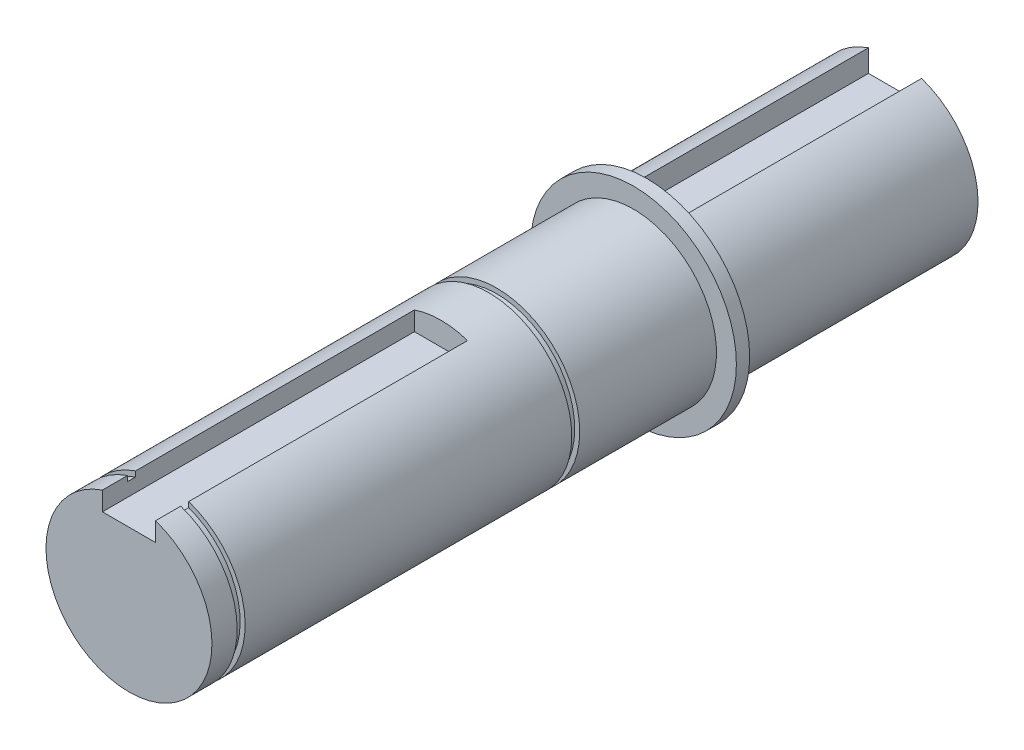
ISO-10303-21;
HEADER;
FILE_DESCRIPTION(('STEP AP214'),'2;1');
FILE_NAME('part.step','',(''),(''),'','','');
FILE_SCHEMA(('AUTOMOTIVE_DESIGN { 1 0 10303 214 1 1 1 1 }'));
ENDSEC;
DATA;
#1=APPLICATION_CONTEXT('core data for automotive mechanical design processes');
#2=APPLICATION_PROTOCOL_DEFINITION('international standard','automotive_design',2000,#1);
#3=PRODUCT_CONTEXT('',#1,'mechanical');
#4=PRODUCT('Part','Part','',(#3));
#5=PRODUCT_RELATED_PRODUCT_CATEGORY('part','',(#4));
#6=PRODUCT_DEFINITION_FORMATION('','',#4);
#7=PRODUCT_DEFINITION_CONTEXT('part definition',#1,'design');
#8=PRODUCT_DEFINITION('design','',#6,#7);
#9=PRODUCT_DEFINITION_SHAPE('','',#8);
#10=(LENGTH_UNIT() NAMED_UNIT(*) SI_UNIT(.MILLI.,.METRE.));
#11=(NAMED_UNIT(*) PLANE_ANGLE_UNIT() SI_UNIT($,.RADIAN.));
#12=(NAMED_UNIT(*) SI_UNIT($,.STERADIAN.) SOLID_ANGLE_UNIT());
#13=UNCERTAINTY_MEASURE_WITH_UNIT(LENGTH_MEASURE(1.E-05),#10,'distance_accuracy_value','');
#14=(GEOMETRIC_REPRESENTATION_CONTEXT(3) GLOBAL_UNCERTAINTY_ASSIGNED_CONTEXT((#13)) GLOBAL_UNIT_ASSIGNED_CONTEXT((#10,
#11,#12)) REPRESENTATION_CONTEXT('',''));
#15=CARTESIAN_POINT('',(0.,0.,0.));
#16=DIRECTION('',(0.,0.,1.));
#17=DIRECTION('',(1.,0.,0.));
#18=AXIS2_PLACEMENT_3D('',#15,#16,#17);
#19=CARTESIAN_POINT('',(0.,0.,115.4));
#20=DIRECTION('',(0.,0.,-1.));
#21=DIRECTION('',(-1.,0.,0.));
#22=AXIS2_PLACEMENT_3D('',#19,#20,#21);
#23=CYLINDRICAL_SURFACE('',#22,12.5);
#24=CARTESIAN_POINT('',(0.,0.,61.2));
#25=DIRECTION('',(0.,0.,1.));
#26=DIRECTION('',(1.,0.,0.));
#27=AXIS2_PLACEMENT_3D('',#24,#25,#26);
#28=CIRCLE('',#27,12.5);
#29=CARTESIAN_POINT('',(12.5,0.,61.2));
#30=VERTEX_POINT('',#29);
#31=EDGE_CURVE('E198',#30,#30,#28,.T.);
#32=ORIENTED_EDGE('',*,*,#31,.T.);
#33=EDGE_LOOP('',(#32));
#34=FACE_BOUND('',#33,.T.);
#35=CARTESIAN_POINT('',(0.,0.,110.4));
#36=DIRECTION('',(0.,0.,1.));
#37=DIRECTION('',(1.,0.,0.));
#38=AXIS2_PLACEMENT_3D('',#35,#36,#37);
#39=CIRCLE('',#38,12.5);
#40=CARTESIAN_POINT('',(-4.,11.842719282327,110.4));
#41=VERTEX_POINT('',#40);
#42=CARTESIAN_POINT('',(4.,11.842719282327,110.4));
#43=VERTEX_POINT('',#42);
#44=EDGE_CURVE('E153',#41,#43,#39,.T.);
#45=ORIENTED_EDGE('',*,*,#44,.F.);
#46=DIRECTION('',(0.,0.,-1.));
#47=VECTOR('',#46,1.);
#48=CARTESIAN_POINT('',(-4.,11.842719282327,115.4));
#49=LINE('',#48,#47);
#50=CARTESIAN_POINT('',(-4.,11.842719282327,68.4));
#51=VERTEX_POINT('',#50);
#52=EDGE_CURVE('E274',#41,#51,#49,.T.);
#53=ORIENTED_EDGE('',*,*,#52,.T.);
#54=CARTESIAN_POINT('',(0.,0.,68.4));
#55=DIRECTION('',(0.,0.,-1.));
#56=DIRECTION('',(-1.,0.,0.));
#57=AXIS2_PLACEMENT_3D('',#54,#55,#56);
#58=CIRCLE('',#57,12.5);
#59=CARTESIAN_POINT('',(4.,11.842719282327,68.4));
#60=VERTEX_POINT('',#59);
#61=EDGE_CURVE('E270',#51,#60,#58,.T.);
#62=ORIENTED_EDGE('',*,*,#61,.T.);
#63=DIRECTION('',(0.,0.,-1.));
#64=VECTOR('',#63,1.);
#65=CARTESIAN_POINT('',(4.,11.842719282327,115.4));
#66=LINE('',#65,#64);
#67=EDGE_CURVE('E279',#60,#43,#66,.F.);
#68=ORIENTED_EDGE('',*,*,#67,.T.);
#69=EDGE_LOOP('',(#45,#53,#62,#68));
#70=FACE_BOUND('',#69,.T.);
#71=ADVANCED_FACE('F45',(#34,#70),#23,.T.);
#72=CARTESIAN_POINT('',(0.,0.,39.4));
#73=DIRECTION('',(0.,0.,-1.));
#74=DIRECTION('',(-1.,0.,0.));
#75=AXIS2_PLACEMENT_3D('',#72,#73,#74);
#76=CIRCLE('',#75,12.5);
#77=CARTESIAN_POINT('',(-12.5,0.,39.4));
#78=VERTEX_POINT('',#77);
#79=EDGE_CURVE('E263',#78,#78,#76,.T.);
#80=ORIENTED_EDGE('',*,*,#79,.F.);
#81=EDGE_LOOP('',(#80));
#82=FACE_BOUND('',#81,.T.);
#83=CARTESIAN_POINT('',(0.,0.,60.));
#84=DIRECTION('',(0.,0.,1.));
#85=DIRECTION('',(1.,0.,0.));
#86=AXIS2_PLACEMENT_3D('',#83,#84,#85);
#87=CIRCLE('',#86,12.5);
#88=CARTESIAN_POINT('',(12.5,0.,60.));
#89=VERTEX_POINT('',#88);
#90=EDGE_CURVE('E194',#89,#89,#87,.T.);
#91=ORIENTED_EDGE('',*,*,#90,.F.);
#92=EDGE_LOOP('',(#91));
#93=FACE_BOUND('',#92,.T.);
#94=ADVANCED_FACE('F322',(#82,#93),#23,.T.);
#95=CARTESIAN_POINT('',(0.,0.,37.4));
#96=DIRECTION('',(0.,0.,-1.));
#97=DIRECTION('',(-1.,0.,0.));
#98=AXIS2_PLACEMENT_3D('',#95,#96,#97);
#99=CIRCLE('',#98,12.5);
#100=CARTESIAN_POINT('',(-12.5,0.,37.4));
#101=VERTEX_POINT('',#100);
#102=EDGE_CURVE('E210',#101,#101,#99,.T.);
#103=ORIENTED_EDGE('',*,*,#102,.T.);
#104=EDGE_LOOP('',(#103));
#105=FACE_BOUND('',#104,.T.);
#106=CARTESIAN_POINT('',(0.,0.,35.4));
#107=DIRECTION('',(0.,0.,1.));
#108=DIRECTION('',(1.,0.,0.));
#109=AXIS2_PLACEMENT_3D('',#106,#107,#108);
#110=CIRCLE('',#109,12.5);
#111=CARTESIAN_POINT('',(4.,11.842719282327,35.4));
#112=VERTEX_POINT('',#111);
#113=CARTESIAN_POINT('',(-4.,11.842719282327,35.4));
#114=VERTEX_POINT('',#113);
#115=EDGE_CURVE('E259',#112,#114,#110,.T.);
#116=ORIENTED_EDGE('',*,*,#115,.T.);
#117=DIRECTION('',(0.,0.,-1.));
#118=VECTOR('',#117,1.);
#119=CARTESIAN_POINT('',(-4.,11.842719282327,115.4));
#120=LINE('',#119,#118);
#121=CARTESIAN_POINT('',(-4.,11.842719282327,0.));
#122=VERTEX_POINT('',#121);
#123=EDGE_CURVE('E243',#114,#122,#120,.T.);
#124=ORIENTED_EDGE('',*,*,#123,.T.);
#125=CARTESIAN_POINT('',(0.,0.,0.));
#126=DIRECTION('',(0.,0.,1.));
#127=DIRECTION('',(1.,0.,0.));
#128=AXIS2_PLACEMENT_3D('',#125,#126,#127);
#129=CIRCLE('',#128,12.5);
#130=CARTESIAN_POINT('',(4.,11.842719282327,0.));
#131=VERTEX_POINT('',#130);
#132=EDGE_CURVE('E247',#122,#131,#129,.T.);
#133=ORIENTED_EDGE('',*,*,#132,.T.);
#134=DIRECTION('',(0.,0.,-1.));
#135=VECTOR('',#134,1.);
#136=CARTESIAN_POINT('',(4.,11.842719282327,115.4));
#137=LINE('',#136,#135);
#138=EDGE_CURVE('E236',#131,#112,#137,.F.);
#139=ORIENTED_EDGE('',*,*,#138,.T.);
#140=EDGE_LOOP('',(#116,#124,#133,#139));
#141=FACE_BOUND('',#140,.T.);
#142=ADVANCED_FACE('F47',(#105,#141),#23,.T.);
#143=CARTESIAN_POINT('',(0.,0.,0.));
#144=DIRECTION('',(0.,0.,1.));
#145=DIRECTION('',(1.,0.,0.));
#146=AXIS2_PLACEMENT_3D('',#143,#144,#145);
#147=PLANE('',#146);
#148=ORIENTED_EDGE('',*,*,#132,.F.);
#149=DIRECTION('',(0.,1.,0.));
#150=VECTOR('',#149,1.);
#151=CARTESIAN_POINT('',(-4.,8.5,0.));
#152=LINE('',#151,#150);
#153=CARTESIAN_POINT('',(-4.,8.5,0.));
#154=VERTEX_POINT('',#153);
#155=EDGE_CURVE('E227',#154,#122,#152,.T.);
#156=ORIENTED_EDGE('',*,*,#155,.F.);
#157=DIRECTION('',(-1.,0.,0.));
#158=VECTOR('',#157,1.);
#159=CARTESIAN_POINT('',(4.,8.5,0.));
#160=LINE('',#159,#158);
#161=CARTESIAN_POINT('',(4.,8.5,0.));
#162=VERTEX_POINT('',#161);
#163=EDGE_CURVE('E219',#162,#154,#160,.T.);
#164=ORIENTED_EDGE('',*,*,#163,.F.);
#165=DIRECTION('',(0.,1.,0.));
#166=VECTOR('',#165,1.);
#167=CARTESIAN_POINT('',(4.,0.,0.));
#168=LINE('',#167,#166);
#169=EDGE_CURVE('E252',#162,#131,#168,.T.);
#170=ORIENTED_EDGE('',*,*,#169,.T.);
#171=EDGE_LOOP('',(#148,#156,#164,#170));
#172=FACE_BOUND('',#171,.T.);
#173=ADVANCED_FACE('F329',(#172),#147,.F.);
#174=CARTESIAN_POINT('',(0.,0.,35.4));
#175=DIRECTION('',(0.,0.,1.));
#176=DIRECTION('',(1.,0.,0.));
#177=AXIS2_PLACEMENT_3D('',#174,#175,#176);
#178=PLANE('',#177);
#179=DIRECTION('',(0.,-1.,0.));
#180=VECTOR('',#179,1.);
#181=CARTESIAN_POINT('',(4.,8.5,35.4));
#182=LINE('',#181,#180);
#183=CARTESIAN_POINT('',(4.,8.5,35.4));
#184=VERTEX_POINT('',#183);
#185=EDGE_CURVE('E218',#112,#184,#182,.T.);
#186=ORIENTED_EDGE('',*,*,#185,.T.);
#187=DIRECTION('',(-1.,0.,0.));
#188=VECTOR('',#187,1.);
#189=CARTESIAN_POINT('',(4.,8.5,35.4));
#190=LINE('',#189,#188);
#191=CARTESIAN_POINT('',(-4.,8.5,35.4));
#192=VERTEX_POINT('',#191);
#193=EDGE_CURVE('E222',#184,#192,#190,.T.);
#194=ORIENTED_EDGE('',*,*,#193,.T.);
#195=DIRECTION('',(0.,1.,0.));
#196=VECTOR('',#195,1.);
#197=CARTESIAN_POINT('',(-4.,8.5,35.4));
#198=LINE('',#197,#196);
#199=EDGE_CURVE('E214',#192,#114,#198,.T.);
#200=ORIENTED_EDGE('',*,*,#199,.T.);
#201=ORIENTED_EDGE('',*,*,#115,.F.);
#202=EDGE_LOOP('',(#186,#194,#200,#201));
#203=FACE_BOUND('',#202,.T.);
#204=ADVANCED_FACE('F334',(#203),#178,.F.);
#205=CARTESIAN_POINT('',(-4.,8.5,35.4));
#206=DIRECTION('',(-1.,0.,0.));
#207=DIRECTION('',(0.,0.,1.));
#208=AXIS2_PLACEMENT_3D('',#205,#206,#207);
#209=PLANE('',#208);
#210=ORIENTED_EDGE('',*,*,#199,.F.);
#211=DIRECTION('',(0.,0.,-1.));
#212=VECTOR('',#211,1.);
#213=CARTESIAN_POINT('',(-4.,8.5,35.4));
#214=LINE('',#213,#212);
#215=EDGE_CURVE('E233',#192,#154,#214,.T.);
#216=ORIENTED_EDGE('',*,*,#215,.T.);
#217=ORIENTED_EDGE('',*,*,#155,.T.);
#218=ORIENTED_EDGE('',*,*,#123,.F.);
#219=EDGE_LOOP('',(#210,#216,#217,#218));
#220=FACE_BOUND('',#219,.T.);
#221=ADVANCED_FACE('F352',(#220),#209,.F.);
#222=CARTESIAN_POINT('',(4.,8.5,35.4));
#223=DIRECTION('',(1.,0.,0.));
#224=DIRECTION('',(0.,0.,-1.));
#225=AXIS2_PLACEMENT_3D('',#222,#223,#224);
#226=PLANE('',#225);
#227=ORIENTED_EDGE('',*,*,#169,.F.);
#228=DIRECTION('',(0.,0.,-1.));
#229=VECTOR('',#228,1.);
#230=CARTESIAN_POINT('',(4.,8.5,35.4));
#231=LINE('',#230,#229);
#232=EDGE_CURVE('E226',#184,#162,#231,.T.);
#233=ORIENTED_EDGE('',*,*,#232,.F.);
#234=ORIENTED_EDGE('',*,*,#185,.F.);
#235=ORIENTED_EDGE('',*,*,#138,.F.);
#236=EDGE_LOOP('',(#227,#233,#234,#235));
#237=FACE_BOUND('',#236,.T.);
#238=ADVANCED_FACE('F355',(#237),#226,.F.);
#239=CARTESIAN_POINT('',(4.,8.5,35.4));
#240=DIRECTION('',(0.,-1.,0.));
#241=DIRECTION('',(0.,0.,-1.));
#242=AXIS2_PLACEMENT_3D('',#239,#240,#241);
#243=PLANE('',#242);
#244=ORIENTED_EDGE('',*,*,#163,.T.);
#245=ORIENTED_EDGE('',*,*,#215,.F.);
#246=ORIENTED_EDGE('',*,*,#193,.F.);
#247=ORIENTED_EDGE('',*,*,#232,.T.);
#248=EDGE_LOOP('',(#244,#245,#246,#247));
#249=FACE_BOUND('',#248,.T.);
#250=ADVANCED_FACE('F359',(#249),#243,.F.);
#251=CARTESIAN_POINT('',(0.,0.,39.4));
#252=DIRECTION('',(0.,0.,-1.));
#253=DIRECTION('',(-1.,0.,0.));
#254=AXIS2_PLACEMENT_3D('',#251,#252,#253);
#255=CYLINDRICAL_SURFACE('',#254,15.5);
#256=CARTESIAN_POINT('',(0.,0.,39.4));
#257=DIRECTION('',(0.,0.,-1.));
#258=DIRECTION('',(-1.,0.,0.));
#259=AXIS2_PLACEMENT_3D('',#256,#257,#258);
#260=CIRCLE('',#259,15.5);
#261=CARTESIAN_POINT('',(-15.5,0.,39.4));
#262=VERTEX_POINT('',#261);
#263=EDGE_CURVE('E206',#262,#262,#260,.T.);
#264=ORIENTED_EDGE('',*,*,#263,.T.);
#265=EDGE_LOOP('',(#264));
#266=FACE_BOUND('',#265,.T.);
#267=CARTESIAN_POINT('',(0.,0.,37.4));
#268=DIRECTION('',(0.,0.,-1.));
#269=DIRECTION('',(-1.,0.,0.));
#270=AXIS2_PLACEMENT_3D('',#267,#268,#269);
#271=CIRCLE('',#270,15.5);
#272=CARTESIAN_POINT('',(-15.5,0.,37.4));
#273=VERTEX_POINT('',#272);
#274=EDGE_CURVE('E202',#273,#273,#271,.T.);
#275=ORIENTED_EDGE('',*,*,#274,.F.);
#276=EDGE_LOOP('',(#275));
#277=FACE_BOUND('',#276,.T.);
#278=ADVANCED_FACE('F363',(#266,#277),#255,.T.);
#279=CARTESIAN_POINT('',(0.,0.,39.4));
#280=DIRECTION('',(0.,0.,-1.));
#281=DIRECTION('',(-1.,0.,0.));
#282=AXIS2_PLACEMENT_3D('',#279,#280,#281);
#283=PLANE('',#282);
#284=ORIENTED_EDGE('',*,*,#79,.T.);
#285=EDGE_LOOP('',(#284));
#286=FACE_BOUND('',#285,.T.);
#287=ORIENTED_EDGE('',*,*,#263,.F.);
#288=EDGE_LOOP('',(#287));
#289=FACE_BOUND('',#288,.T.);
#290=ADVANCED_FACE('F370',(#286,#289),#283,.F.);
#291=CARTESIAN_POINT('',(0.,0.,37.4));
#292=DIRECTION('',(0.,0.,-1.));
#293=DIRECTION('',(-1.,0.,0.));
#294=AXIS2_PLACEMENT_3D('',#291,#292,#293);
#295=PLANE('',#294);
#296=ORIENTED_EDGE('',*,*,#102,.F.);
#297=EDGE_LOOP('',(#296));
#298=FACE_BOUND('',#297,.T.);
#299=ORIENTED_EDGE('',*,*,#274,.T.);
#300=EDGE_LOOP('',(#299));
#301=FACE_BOUND('',#300,.T.);
#302=ADVANCED_FACE('F372',(#298,#301),#295,.T.);
#303=CARTESIAN_POINT('',(0.,0.,61.2));
#304=DIRECTION('',(0.,0.,1.));
#305=DIRECTION('',(1.,0.,0.));
#306=AXIS2_PLACEMENT_3D('',#303,#304,#305);
#307=PLANE('',#306);
#308=ORIENTED_EDGE('',*,*,#31,.F.);
#309=EDGE_LOOP('',(#308));
#310=FACE_BOUND('',#309,.T.);
#311=CARTESIAN_POINT('',(0.,0.,61.2));
#312=DIRECTION('',(0.,0.,1.));
#313=DIRECTION('',(1.,0.,0.));
#314=AXIS2_PLACEMENT_3D('',#311,#312,#313);
#315=CIRCLE('',#314,11.75);
#316=CARTESIAN_POINT('',(11.75,0.,61.2));
#317=VERTEX_POINT('',#316);
#318=EDGE_CURVE('E190',#317,#317,#315,.T.);
#319=ORIENTED_EDGE('',*,*,#318,.T.);
#320=EDGE_LOOP('',(#319));
#321=FACE_BOUND('',#320,.T.);
#322=ADVANCED_FACE('F375',(#310,#321),#307,.F.);
#323=CARTESIAN_POINT('',(0.,0.,60.));
#324=DIRECTION('',(0.,0.,1.));
#325=DIRECTION('',(1.,0.,0.));
#326=AXIS2_PLACEMENT_3D('',#323,#324,#325);
#327=PLANE('',#326);
#328=ORIENTED_EDGE('',*,*,#90,.T.);
#329=EDGE_LOOP('',(#328));
#330=FACE_BOUND('',#329,.T.);
#331=CARTESIAN_POINT('',(0.,0.,60.));
#332=DIRECTION('',(0.,0.,1.));
#333=DIRECTION('',(1.,0.,0.));
#334=AXIS2_PLACEMENT_3D('',#331,#332,#333);
#335=CIRCLE('',#334,11.75);
#336=CARTESIAN_POINT('',(11.75,0.,60.));
#337=VERTEX_POINT('',#336);
#338=EDGE_CURVE('E186',#337,#337,#335,.T.);
#339=ORIENTED_EDGE('',*,*,#338,.F.);
#340=EDGE_LOOP('',(#339));
#341=FACE_BOUND('',#340,.T.);
#342=ADVANCED_FACE('F348',(#330,#341),#327,.T.);
#343=CARTESIAN_POINT('',(0.,0.,61.2));
#344=DIRECTION('',(0.,0.,-1.));
#345=DIRECTION('',(-1.,0.,0.));
#346=AXIS2_PLACEMENT_3D('',#343,#344,#345);
#347=CYLINDRICAL_SURFACE('',#346,11.75);
#348=ORIENTED_EDGE('',*,*,#318,.F.);
#349=EDGE_LOOP('',(#348));
#350=FACE_BOUND('',#349,.T.);
#351=ORIENTED_EDGE('',*,*,#338,.T.);
#352=EDGE_LOOP('',(#351));
#353=FACE_BOUND('',#352,.T.);
#354=ADVANCED_FACE('F343',(#350,#353),#347,.T.);
#355=CARTESIAN_POINT('',(0.,0.,115.4));
#356=DIRECTION('',(0.,0.,1.));
#357=DIRECTION('',(1.,0.,0.));
#358=AXIS2_PLACEMENT_3D('',#355,#356,#357);
#359=PLANE('',#358);
#360=DIRECTION('',(0.,1.,0.));
#361=VECTOR('',#360,1.);
#362=CARTESIAN_POINT('',(4.,9.,115.4));
#363=LINE('',#362,#361);
#364=CARTESIAN_POINT('',(4.,9.,115.4));
#365=VERTEX_POINT('',#364);
#366=CARTESIAN_POINT('',(4.,11.842719282327,115.4));
#367=VERTEX_POINT('',#366);
#368=EDGE_CURVE('E160',#365,#367,#363,.T.);
#369=ORIENTED_EDGE('',*,*,#368,.F.);
#370=DIRECTION('',(1.,0.,0.));
#371=VECTOR('',#370,1.);
#372=CARTESIAN_POINT('',(-4.,9.,115.4));
#373=LINE('',#372,#371);
#374=CARTESIAN_POINT('',(-4.,9.,115.4));
#375=VERTEX_POINT('',#374);
#376=EDGE_CURVE('E171',#375,#365,#373,.T.);
#377=ORIENTED_EDGE('',*,*,#376,.F.);
#378=DIRECTION('',(0.,-1.,0.));
#379=VECTOR('',#378,1.);
#380=CARTESIAN_POINT('',(-4.,9.,115.4));
#381=LINE('',#380,#379);
#382=CARTESIAN_POINT('',(-4.,11.842719282327,115.4));
#383=VERTEX_POINT('',#382);
#384=EDGE_CURVE('E164',#383,#375,#381,.T.);
#385=ORIENTED_EDGE('',*,*,#384,.F.);
#386=CARTESIAN_POINT('',(0.,0.,115.4));
#387=DIRECTION('',(0.,0.,1.));
#388=DIRECTION('',(1.,0.,0.));
#389=AXIS2_PLACEMENT_3D('',#386,#387,#388);
#390=CIRCLE('',#389,12.5);
#391=EDGE_CURVE('E248',#383,#367,#390,.T.);
#392=ORIENTED_EDGE('',*,*,#391,.T.);
#393=EDGE_LOOP('',(#369,#377,#385,#392));
#394=FACE_BOUND('',#393,.T.);
#395=ADVANCED_FACE('F307',(#394),#359,.T.);
#396=CARTESIAN_POINT('',(-4.,11.842719282327,111.6));
#397=VERTEX_POINT('',#396);
#398=EDGE_CURVE('E275',#383,#397,#49,.T.);
#399=ORIENTED_EDGE('',*,*,#398,.T.);
#400=CARTESIAN_POINT('',(0.,0.,111.6));
#401=DIRECTION('',(0.,0.,1.));
#402=DIRECTION('',(1.,0.,0.));
#403=AXIS2_PLACEMENT_3D('',#400,#401,#402);
#404=CIRCLE('',#403,12.5);
#405=CARTESIAN_POINT('',(4.,11.842719282327,111.6));
#406=VERTEX_POINT('',#405);
#407=EDGE_CURVE('E145',#397,#406,#404,.T.);
#408=ORIENTED_EDGE('',*,*,#407,.T.);
#409=EDGE_CURVE('E158',#406,#367,#66,.F.);
#410=ORIENTED_EDGE('',*,*,#409,.T.);
#411=ORIENTED_EDGE('',*,*,#391,.F.);
#412=EDGE_LOOP('',(#399,#408,#410,#411));
#413=FACE_BOUND('',#412,.T.);
#414=ADVANCED_FACE('F302',(#413),#23,.T.);
#415=CARTESIAN_POINT('',(4.,9.,68.4));
#416=DIRECTION('',(1.,0.,0.));
#417=DIRECTION('',(0.,0.,-1.));
#418=AXIS2_PLACEMENT_3D('',#415,#416,#417);
#419=PLANE('',#418);
#420=ORIENTED_EDGE('',*,*,#409,.F.);
#421=DIRECTION('',(0.,-1.,0.));
#422=VECTOR('',#421,1.);
#423=CARTESIAN_POINT('',(4.,9.,111.6));
#424=LINE('',#423,#422);
#425=CARTESIAN_POINT('',(4.,11.0481898969922,111.6));
#426=VERTEX_POINT('',#425);
#427=EDGE_CURVE('E149',#406,#426,#424,.T.);
#428=ORIENTED_EDGE('',*,*,#427,.T.);
#429=DIRECTION('',(0.,0.,-1.));
#430=VECTOR('',#429,1.);
#431=CARTESIAN_POINT('',(4.,11.0481898969922,111.6));
#432=LINE('',#431,#430);
#433=CARTESIAN_POINT('',(4.,11.0481898969922,110.4));
#434=VERTEX_POINT('',#433);
#435=EDGE_CURVE('E136',#426,#434,#432,.T.);
#436=ORIENTED_EDGE('',*,*,#435,.T.);
#437=DIRECTION('',(0.,-1.,0.));
#438=VECTOR('',#437,1.);
#439=CARTESIAN_POINT('',(4.,9.,110.4));
#440=LINE('',#439,#438);
#441=EDGE_CURVE('E144',#43,#434,#440,.T.);
#442=ORIENTED_EDGE('',*,*,#441,.F.);
#443=ORIENTED_EDGE('',*,*,#67,.F.);
#444=DIRECTION('',(0.,1.,0.));
#445=VECTOR('',#444,1.);
#446=CARTESIAN_POINT('',(4.,9.,68.4));
#447=LINE('',#446,#445);
#448=CARTESIAN_POINT('',(4.,9.,68.4));
#449=VERTEX_POINT('',#448);
#450=EDGE_CURVE('E69',#449,#60,#447,.T.);
#451=ORIENTED_EDGE('',*,*,#450,.F.);
#452=DIRECTION('',(0.,0.,1.));
#453=VECTOR('',#452,1.);
#454=CARTESIAN_POINT('',(4.,9.,68.4));
#455=LINE('',#454,#453);
#456=EDGE_CURVE('E183',#449,#365,#455,.T.);
#457=ORIENTED_EDGE('',*,*,#456,.T.);
#458=ORIENTED_EDGE('',*,*,#368,.T.);
#459=EDGE_LOOP('',(#420,#428,#436,#442,#443,#451,#457,#458));
#460=FACE_BOUND('',#459,.T.);
#461=ADVANCED_FACE('F156',(#460),#419,.F.);
#462=CARTESIAN_POINT('',(-4.,9.,68.4));
#463=DIRECTION('',(-1.,0.,0.));
#464=DIRECTION('',(0.,0.,1.));
#465=AXIS2_PLACEMENT_3D('',#462,#463,#464);
#466=PLANE('',#465);
#467=DIRECTION('',(0.,0.,-1.));
#468=VECTOR('',#467,1.);
#469=CARTESIAN_POINT('',(-4.,11.0481898969922,111.6));
#470=LINE('',#469,#468);
#471=CARTESIAN_POINT('',(-4.,11.0481898969922,110.4));
#472=VERTEX_POINT('',#471);
#473=CARTESIAN_POINT('',(-4.,11.0481898969922,111.6));
#474=VERTEX_POINT('',#473);
#475=EDGE_CURVE('E283',#472,#474,#470,.F.);
#476=ORIENTED_EDGE('',*,*,#475,.T.);
#477=DIRECTION('',(0.,1.,0.));
#478=VECTOR('',#477,1.);
#479=CARTESIAN_POINT('',(-4.,9.,111.6));
#480=LINE('',#479,#478);
#481=EDGE_CURVE('E12',#474,#397,#480,.T.);
#482=ORIENTED_EDGE('',*,*,#481,.T.);
#483=ORIENTED_EDGE('',*,*,#398,.F.);
#484=ORIENTED_EDGE('',*,*,#384,.T.);
#485=DIRECTION('',(0.,0.,1.));
#486=VECTOR('',#485,1.);
#487=CARTESIAN_POINT('',(-4.,9.,68.4));
#488=LINE('',#487,#486);
#489=CARTESIAN_POINT('',(-4.,9.,68.4));
#490=VERTEX_POINT('',#489);
#491=EDGE_CURVE('E176',#490,#375,#488,.T.);
#492=ORIENTED_EDGE('',*,*,#491,.F.);
#493=DIRECTION('',(0.,-1.,0.));
#494=VECTOR('',#493,1.);
#495=CARTESIAN_POINT('',(-4.,9.,68.4));
#496=LINE('',#495,#494);
#497=EDGE_CURVE('E170',#51,#490,#496,.T.);
#498=ORIENTED_EDGE('',*,*,#497,.F.);
#499=ORIENTED_EDGE('',*,*,#52,.F.);
#500=DIRECTION('',(0.,1.,0.));
#501=VECTOR('',#500,1.);
#502=CARTESIAN_POINT('',(-4.,9.,110.4));
#503=LINE('',#502,#501);
#504=EDGE_CURVE('E54',#472,#41,#503,.T.);
#505=ORIENTED_EDGE('',*,*,#504,.F.);
#506=EDGE_LOOP('',(#476,#482,#483,#484,#492,#498,#499,#505));
#507=FACE_BOUND('',#506,.T.);
#508=ADVANCED_FACE('F296',(#507),#466,.F.);
#509=CARTESIAN_POINT('',(0.,0.,68.4));
#510=DIRECTION('',(0.,0.,-1.));
#511=DIRECTION('',(-1.,0.,0.));
#512=AXIS2_PLACEMENT_3D('',#509,#510,#511);
#513=PLANE('',#512);
#514=ORIENTED_EDGE('',*,*,#497,.T.);
#515=DIRECTION('',(1.,0.,0.));
#516=VECTOR('',#515,1.);
#517=CARTESIAN_POINT('',(-4.,9.,68.4));
#518=LINE('',#517,#516);
#519=EDGE_CURVE('E174',#490,#449,#518,.T.);
#520=ORIENTED_EDGE('',*,*,#519,.T.);
#521=ORIENTED_EDGE('',*,*,#450,.T.);
#522=ORIENTED_EDGE('',*,*,#61,.F.);
#523=EDGE_LOOP('',(#514,#520,#521,#522));
#524=FACE_BOUND('',#523,.T.);
#525=ADVANCED_FACE('F311',(#524),#513,.F.);
#526=CARTESIAN_POINT('',(-4.,9.,68.4));
#527=DIRECTION('',(0.,-1.,0.));
#528=DIRECTION('',(0.,0.,-1.));
#529=AXIS2_PLACEMENT_3D('',#526,#527,#528);
#530=PLANE('',#529);
#531=ORIENTED_EDGE('',*,*,#376,.T.);
#532=ORIENTED_EDGE('',*,*,#456,.F.);
#533=ORIENTED_EDGE('',*,*,#519,.F.);
#534=ORIENTED_EDGE('',*,*,#491,.T.);
#535=EDGE_LOOP('',(#531,#532,#533,#534));
#536=FACE_BOUND('',#535,.T.);
#537=ADVANCED_FACE('F310',(#536),#530,.F.);
#538=CARTESIAN_POINT('',(0.,0.,111.6));
#539=DIRECTION('',(0.,0.,1.));
#540=DIRECTION('',(1.,0.,0.));
#541=AXIS2_PLACEMENT_3D('',#538,#539,#540);
#542=PLANE('',#541);
#543=ORIENTED_EDGE('',*,*,#407,.F.);
#544=ORIENTED_EDGE('',*,*,#481,.F.);
#545=CARTESIAN_POINT('',(0.,0.,111.6));
#546=DIRECTION('',(0.,0.,1.));
#547=DIRECTION('',(1.,0.,0.));
#548=AXIS2_PLACEMENT_3D('',#545,#546,#547);
#549=CIRCLE('',#548,11.75);
#550=EDGE_CURVE('E61',#474,#426,#549,.T.);
#551=ORIENTED_EDGE('',*,*,#550,.T.);
#552=ORIENTED_EDGE('',*,*,#427,.F.);
#553=EDGE_LOOP('',(#543,#544,#551,#552));
#554=FACE_BOUND('',#553,.T.);
#555=ADVANCED_FACE('F148',(#554),#542,.F.);
#556=CARTESIAN_POINT('',(0.,0.,110.4));
#557=DIRECTION('',(0.,0.,1.));
#558=DIRECTION('',(1.,0.,0.));
#559=AXIS2_PLACEMENT_3D('',#556,#557,#558);
#560=PLANE('',#559);
#561=ORIENTED_EDGE('',*,*,#441,.T.);
#562=CARTESIAN_POINT('',(0.,0.,110.4));
#563=DIRECTION('',(0.,0.,1.));
#564=DIRECTION('',(1.,0.,0.));
#565=AXIS2_PLACEMENT_3D('',#562,#563,#564);
#566=CIRCLE('',#565,11.75);
#567=EDGE_CURVE('E139',#472,#434,#566,.T.);
#568=ORIENTED_EDGE('',*,*,#567,.F.);
#569=ORIENTED_EDGE('',*,*,#504,.T.);
#570=ORIENTED_EDGE('',*,*,#44,.T.);
#571=EDGE_LOOP('',(#561,#568,#569,#570));
#572=FACE_BOUND('',#571,.T.);
#573=ADVANCED_FACE('F289',(#572),#560,.T.);
#574=CARTESIAN_POINT('',(0.,0.,111.6));
#575=DIRECTION('',(0.,0.,-1.));
#576=DIRECTION('',(-1.,0.,0.));
#577=AXIS2_PLACEMENT_3D('',#574,#575,#576);
#578=CYLINDRICAL_SURFACE('',#577,11.75);
#579=ORIENTED_EDGE('',*,*,#550,.F.);
#580=ORIENTED_EDGE('',*,*,#475,.F.);
#581=ORIENTED_EDGE('',*,*,#567,.T.);
#582=ORIENTED_EDGE('',*,*,#435,.F.);
#583=EDGE_LOOP('',(#579,#580,#581,#582));
#584=FACE_BOUND('',#583,.T.);
#585=ADVANCED_FACE('F137',(#584),#578,.T.);
#586=CLOSED_SHELL('',(#71,#94,#142,#173,#204,#221,#238,#250,#278,#290,#302,#322,#342,#354,#395,
#414,#461,#508,#525,#537,#555,#573,#585));
#587=MANIFOLD_SOLID_BREP('B2',#586);
#588=ADVANCED_BREP_SHAPE_REPRESENTATION('',(#18,#587),#14);
#589=SHAPE_DEFINITION_REPRESENTATION(#9,#588);
ENDSEC;
END-ISO-10303-21;
